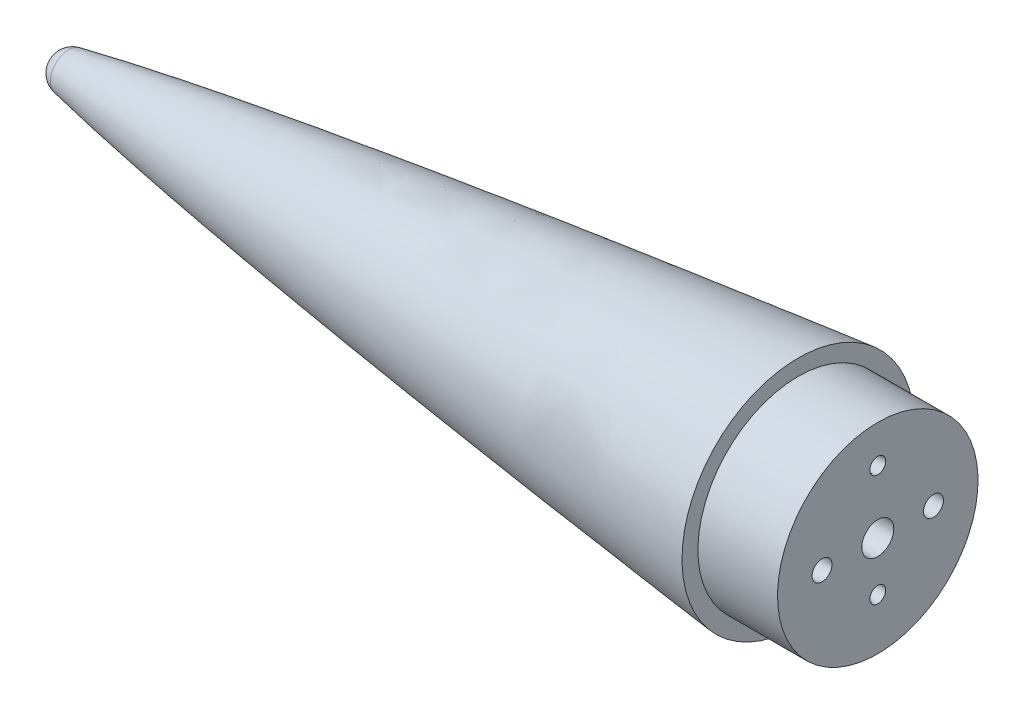
ISO-10303-21;
HEADER;
FILE_DESCRIPTION(('STEP AP214'),'2;1');
FILE_NAME('part.step','',(''),(''),'','','');
FILE_SCHEMA(('AUTOMOTIVE_DESIGN { 1 0 10303 214 1 1 1 1 }'));
ENDSEC;
DATA;
#1=APPLICATION_CONTEXT('core data for automotive mechanical design processes');
#2=APPLICATION_PROTOCOL_DEFINITION('international standard','automotive_design',2000,#1);
#3=PRODUCT_CONTEXT('',#1,'mechanical');
#4=PRODUCT('Part','Part','',(#3));
#5=PRODUCT_RELATED_PRODUCT_CATEGORY('part','',(#4));
#6=PRODUCT_DEFINITION_FORMATION('','',#4);
#7=PRODUCT_DEFINITION_CONTEXT('part definition',#1,'design');
#8=PRODUCT_DEFINITION('design','',#6,#7);
#9=PRODUCT_DEFINITION_SHAPE('','',#8);
#10=(LENGTH_UNIT() NAMED_UNIT(*) SI_UNIT(.MILLI.,.METRE.));
#11=(NAMED_UNIT(*) PLANE_ANGLE_UNIT() SI_UNIT($,.RADIAN.));
#12=(NAMED_UNIT(*) SI_UNIT($,.STERADIAN.) SOLID_ANGLE_UNIT());
#13=UNCERTAINTY_MEASURE_WITH_UNIT(LENGTH_MEASURE(1.E-05),#10,'distance_accuracy_value','');
#14=(GEOMETRIC_REPRESENTATION_CONTEXT(3) GLOBAL_UNCERTAINTY_ASSIGNED_CONTEXT((#13)) GLOBAL_UNIT_ASSIGNED_CONTEXT((#10,
#11,#12)) REPRESENTATION_CONTEXT('',''));
#15=CARTESIAN_POINT('',(0.,0.,0.));
#16=DIRECTION('',(0.,0.,1.));
#17=DIRECTION('',(1.,0.,0.));
#18=AXIS2_PLACEMENT_3D('',#15,#16,#17);
#19=CARTESIAN_POINT('',(25.4,1.27,0.));
#20=CARTESIAN_POINT('',(63.6118581815148,4.61310440314288,0.));
#21=CARTESIAN_POINT('',(101.82371636303,7.95620880628577,0.));
#22=CARTESIAN_POINT('',(140.035574544544,11.2993132094287,0.));
#23=CARTESIAN_POINT('',(25.4,1.27,0.0350466031301165));
#24=CARTESIAN_POINT('',(63.6118581815148,4.61310440314288,0.0350466031301165));
#25=CARTESIAN_POINT('',(101.82371636303,7.95620880628577,0.0350466031301166));
#26=CARTESIAN_POINT('',(140.035574544544,11.2993132094287,0.0350466031301166));
#27=CARTESIAN_POINT('',(25.4,1.26715466031301,0.104480488764327));
#28=CARTESIAN_POINT('',(63.6118581815148,4.61025906345589,0.104480488764327));
#29=CARTESIAN_POINT('',(101.82371636303,7.95336346659878,0.104480488764327));
#30=CARTESIAN_POINT('',(140.035574544544,11.2964678697417,0.104480488764327));
#31=CARTESIAN_POINT('',(25.4,1.25467853458071,0.206325452478428));
#32=CARTESIAN_POINT('',(63.6118581815148,4.59778293772359,0.206325452478428));
#33=CARTESIAN_POINT('',(101.82371636303,7.94088734086647,0.206325452478428));
#34=CARTESIAN_POINT('',(140.035574544544,11.2839917440094,0.206325452478428));
#35=CARTESIAN_POINT('',(25.4,1.23432219550573,0.305536648596169));
#36=CARTESIAN_POINT('',(63.6118581815148,4.57742659864861,0.305536648596169));
#37=CARTESIAN_POINT('',(101.82371636303,7.9205310017915,0.305536648596169));
#38=CARTESIAN_POINT('',(140.035574544544,11.2636354049344,0.305536648596169));
#39=CARTESIAN_POINT('',(25.4,1.06687029815468,0.88303380256959));
#40=CARTESIAN_POINT('',(63.6118581815148,4.40997470129756,0.88303380256959));
#41=CARTESIAN_POINT('',(101.82371636303,7.75307910444044,0.88303380256959));
#42=CARTESIAN_POINT('',(140.035574544544,11.0961835075833,0.88303380256959));
#43=CARTESIAN_POINT('',(25.4,0.56074565008187,1.27));
#44=CARTESIAN_POINT('',(63.6118581815148,3.90385005322475,1.27));
#45=CARTESIAN_POINT('',(101.82371636303,7.24695445636764,1.27));
#46=CARTESIAN_POINT('',(140.035574544544,10.5900588595105,1.27));
#47=CARTESIAN_POINT('',(25.4,-0.700932062602337,1.27));
#48=CARTESIAN_POINT('',(63.6118581815148,2.64217234054055,1.27));
#49=CARTESIAN_POINT('',(101.82371636303,5.98527674368343,1.27));
#50=CARTESIAN_POINT('',(140.035574544544,9.32838114682631,1.27));
#51=CARTESIAN_POINT('',(25.4,-1.27,0.700932062602337));
#52=CARTESIAN_POINT('',(63.6118581815148,2.07310440314288,0.700932062602337));
#53=CARTESIAN_POINT('',(101.82371636303,5.41620880628577,0.700932062602337));
#54=CARTESIAN_POINT('',(140.035574544544,8.75931320942865,0.700932062602337));
#55=CARTESIAN_POINT('',(25.4,-1.27,-0.700932062602337));
#56=CARTESIAN_POINT('',(63.6118581815148,2.07310440314288,-0.700932062602337));
#57=CARTESIAN_POINT('',(101.82371636303,5.41620880628577,-0.700932062602337));
#58=CARTESIAN_POINT('',(140.035574544544,8.75931320942865,-0.700932062602337));
#59=CARTESIAN_POINT('',(25.4,-0.700932062602337,-1.27));
#60=CARTESIAN_POINT('',(63.6118581815148,2.64217234054055,-1.27));
#61=CARTESIAN_POINT('',(101.82371636303,5.98527674368343,-1.27));
#62=CARTESIAN_POINT('',(140.035574544544,9.32838114682631,-1.27));
#63=CARTESIAN_POINT('',(25.4,0.560745650081869,-1.27));
#64=CARTESIAN_POINT('',(63.6118581815148,3.90385005322475,-1.27));
#65=CARTESIAN_POINT('',(101.82371636303,7.24695445636764,-1.27));
#66=CARTESIAN_POINT('',(140.035574544544,10.5900588595105,-1.27));
#67=CARTESIAN_POINT('',(25.4,1.06687029815468,-0.88303380256959));
#68=CARTESIAN_POINT('',(63.6118581815148,4.40997470129756,-0.88303380256959));
#69=CARTESIAN_POINT('',(101.82371636303,7.75307910444044,-0.88303380256959));
#70=CARTESIAN_POINT('',(140.035574544544,11.0961835075833,-0.88303380256959));
#71=CARTESIAN_POINT('',(25.4,1.23432219550573,-0.305536648596169));
#72=CARTESIAN_POINT('',(63.6118581815148,4.57742659864862,-0.305536648596169));
#73=CARTESIAN_POINT('',(101.82371636303,7.9205310017915,-0.305536648596169));
#74=CARTESIAN_POINT('',(140.035574544544,11.2636354049344,-0.305536648596169));
#75=CARTESIAN_POINT('',(25.4,1.25467853458071,-0.206325452478428));
#76=CARTESIAN_POINT('',(63.6118581815148,4.59778293772359,-0.206325452478428));
#77=CARTESIAN_POINT('',(101.82371636303,7.94088734086647,-0.206325452478428));
#78=CARTESIAN_POINT('',(140.035574544544,11.2839917440094,-0.206325452478428));
#79=CARTESIAN_POINT('',(25.4,1.26715466031301,-0.104480488764327));
#80=CARTESIAN_POINT('',(63.6118581815148,4.61025906345589,-0.104480488764327));
#81=CARTESIAN_POINT('',(101.82371636303,7.95336346659878,-0.104480488764327));
#82=CARTESIAN_POINT('',(140.035574544544,11.2964678697417,-0.104480488764327));
#83=CARTESIAN_POINT('',(25.4,1.27,-0.0350466031301169));
#84=CARTESIAN_POINT('',(63.6118581815148,4.61310440314288,-0.0350466031301169));
#85=CARTESIAN_POINT('',(101.82371636303,7.95620880628577,-0.0350466031301169));
#86=CARTESIAN_POINT('',(140.035574544544,11.2993132094287,-0.0350466031301169));
#87=CARTESIAN_POINT('',(25.4,1.27,0.));
#88=CARTESIAN_POINT('',(63.6118581815148,4.61310440314288,0.));
#89=CARTESIAN_POINT('',(101.82371636303,7.95620880628577,0.));
#90=CARTESIAN_POINT('',(140.035574544544,11.2993132094287,0.));
#91=B_SPLINE_SURFACE_WITH_KNOTS('',3,3,((#19,#20,#21,#22),(#23,#24,#25,#26),(#27,#28,#29,#30),
(#31,#32,#33,#34),(#35,#36,#37,#38),(#39,#40,#41,#42),(#43,#44,#45,#46),(#47,#48,#49,#50),(#51,
#52,#53,#54),(#55,#56,#57,#58),(#59,#60,#61,#62),(#63,#64,#65,#66),(#67,#68,#69,#70),(#71,#72,
#73,#74),(#75,#76,#77,#78),(#79,#80,#81,#82),(#83,#84,#85,#86),(#87,#88,#89,#90)),.UNSPECIFIED.,
.T.,.F.,.F.,(4,1,1,1,1,2,2,2,1,1,1,1,4),(4,4),(0.,0.0125,0.0249999999999999,0.0375000000000001,
0.05,0.25,0.5,0.75,0.95,0.9625,0.975,0.9875,1.),(0.,1.),.UNSPECIFIED.);
#92=CARTESIAN_POINT('',(140.035574544544,10.0293132094286,0.));
#93=DIRECTION('',(1.,0.,0.));
#94=DIRECTION('',(0.,1.,0.));
#95=AXIS2_PLACEMENT_3D('',#92,#93,#94);
#96=CIRCLE('',#95,1.27);
#97=CARTESIAN_POINT('',(140.035574544544,11.2993132094287,0.));
#98=VERTEX_POINT('',#97);
#99=EDGE_CURVE('E279',#98,#98,#96,.T.);
#100=CARTESIAN_POINT('',(25.4,0.,0.));
#101=DIRECTION('',(1.,0.,0.));
#102=DIRECTION('',(0.,0.,-1.));
#103=AXIS2_PLACEMENT_3D('',#100,#101,#102);
#104=CIRCLE('',#103,1.27);
#105=CARTESIAN_POINT('',(25.4,0.,-1.27));
#106=VERTEX_POINT('',#105);
#107=EDGE_CURVE('E132',#106,#106,#104,.T.);
#108=CARTESIAN_POINT('',(50.8,1.28529523678131,-0.857017253165904));
#109=CARTESIAN_POINT('',(50.8,1.26120830030249,-0.830700503232783));
#110=CARTESIAN_POINT('',(50.8,1.23823251397369,-0.803389429955764));
#111=CARTESIAN_POINT('',(50.8,1.19464513559847,-0.746941111774847));
#112=CARTESIAN_POINT('',(50.8,1.17403358840814,-0.71780383223904));
#113=CARTESIAN_POINT('',(50.8,1.11604190689717,-0.628025593318513));
#114=CARTESIAN_POINT('',(50.8,1.08240096127345,-0.564904752079824));
#115=CARTESIAN_POINT('',(50.8,1.02622663234572,-0.433866088811166));
#116=CARTESIAN_POINT('',(50.8,1.00370445255427,-0.365943506880282));
#117=CARTESIAN_POINT('',(50.8,0.970477624111287,-0.227226756853895));
#118=CARTESIAN_POINT('',(50.8,0.959772860306507,-0.156432616746877));
#119=CARTESIAN_POINT('',(50.8,0.952678793312112,-0.0498769815468284));
#120=CARTESIAN_POINT('',(50.8,0.951802015297102,-0.0143569682782258));
#121=CARTESIAN_POINT('',(50.8,0.952967584545823,0.0566352104399586));
#122=CARTESIAN_POINT('',(50.8,0.955009896506509,0.0921073764630048));
#123=CARTESIAN_POINT('',(50.8,0.965595570760762,0.198087641531462));
#124=CARTESIAN_POINT('',(50.8,0.97859449177166,0.268206643931548));
#125=CARTESIAN_POINT('',(50.8,1.01639889489829,0.405874702870775));
#126=CARTESIAN_POINT('',(50.8,1.04131793227744,0.473392146768693));
#127=CARTESIAN_POINT('',(50.8,1.10222776731392,0.60319413574191));
#128=CARTESIAN_POINT('',(50.8,1.1382060597687,0.66548449056514));
#129=CARTESIAN_POINT('',(50.8,1.19531596460632,0.747553919408984));
#130=CARTESIAN_POINT('',(50.8,1.21230692623682,0.770305199430718));
#131=CARTESIAN_POINT('',(50.8,1.24773171854024,0.814583337083755));
#132=CARTESIAN_POINT('',(50.8,1.26616270011925,0.836112473907997));
#133=CARTESIAN_POINT('',(50.8,1.28529523678131,0.857017253165905));
#134=B_SPLINE_CURVE_WITH_KNOTS('',3,(#108,#109,#110,#111,#112,#113,#114,#115,#116,#117,#118,
#119,#120,#121,#122,#123,#124,#125,#126,#127,#128,#129,#130,#131,#132,#133),.UNSPECIFIED.,.F.,
.F.,(4,2,2,2,2,2,2,2,2,2,2,2,4),(0.,0.106962050233379,0.213926129493577,0.427398756675607,
0.641086046757289,0.854771254573214,0.96126086173657,1.06774918104115,1.28058585247654,
1.49549173122509,1.71015549451011,1.79529305977988,1.88026624932621),.UNSPECIFIED.);
#135=CARTESIAN_POINT('',(50.8,1.11114409783544,-0.615260193510835));
#136=VERTEX_POINT('',#135);
#137=CARTESIAN_POINT('',(50.8,1.11113297416813,0.615240234713057));
#138=VERTEX_POINT('',#137);
#139=EDGE_CURVE('E14',#136,#138,#134,.T.);
#140=CARTESIAN_POINT('',(50.7999999999998,1.11110602677922,-0.615191852019089));
#141=CARTESIAN_POINT('',(50.8698781786029,1.11110602677923,-0.604173069618746));
#142=CARTESIAN_POINT('',(50.9397019217196,1.11110602677924,-0.592793666969383));
#143=CARTESIAN_POINT('',(51.0793352790334,1.11110602677924,-0.569117732184979));
#144=CARTESIAN_POINT('',(51.1491445927795,1.11110602677924,-0.556819432534417));
#145=CARTESIAN_POINT('',(51.2886234905257,1.11110602677924,-0.531141654962112));
#146=CARTESIAN_POINT('',(51.358292916837,1.11110602677924,-0.517761314795605));
#147=CARTESIAN_POINT('',(51.4962490388009,1.11110602677924,-0.489889899770374));
#148=CARTESIAN_POINT('',(51.5645399896364,1.11110602677924,-0.47542008208526));
#149=CARTESIAN_POINT('',(51.7007081739943,1.11110602677924,-0.44482267570196));
#150=CARTESIAN_POINT('',(51.7685856328018,1.11110602677924,-0.42869609516146));
#151=CARTESIAN_POINT('',(51.9037438327204,1.11110602677924,-0.394201914187369));
#152=CARTESIAN_POINT('',(51.9710248893474,1.11110602677924,-0.375835585244884));
#153=CARTESIAN_POINT('',(52.0596672491461,1.11110602677924,-0.3492435397578));
#154=CARTESIAN_POINT('',(52.0814746120651,1.11110602677924,-0.342506735960934));
#155=CARTESIAN_POINT('',(52.1249548373515,1.11110602677924,-0.32860534005104));
#156=CARTESIAN_POINT('',(52.1466276798344,1.11110602677924,-0.321440686282424));
#157=CARTESIAN_POINT('',(52.2117232973931,1.11110602677924,-0.299093068114507));
#158=CARTESIAN_POINT('',(52.2548975575721,1.11110602677924,-0.283151782887929));
#159=CARTESIAN_POINT('',(52.3189513140578,1.11110602677924,-0.256857704328056));
#160=CARTESIAN_POINT('',(52.3402962254613,1.11110602677924,-0.247640492312448));
#161=CARTESIAN_POINT('',(52.3825133372089,1.11110602677924,-0.228187185672467));
#162=CARTESIAN_POINT('',(52.4033857539186,1.11110602677924,-0.217951569476882));
#163=CARTESIAN_POINT('',(52.4442287644187,1.11110602677924,-0.196195366319065));
#164=CARTESIAN_POINT('',(52.4642054843789,1.11110602677924,-0.18468635787995));
#165=CARTESIAN_POINT('',(52.5029214858518,1.11110602677924,-0.15975990468138));
#166=CARTESIAN_POINT('',(52.5216641850693,1.11110602677924,-0.146348086137208));
#167=CARTESIAN_POINT('',(52.5470321718472,1.11110602677924,-0.124795731418952));
#168=CARTESIAN_POINT('',(52.5546413172591,1.11110602677924,-0.117825381606004));
#169=CARTESIAN_POINT('',(52.5691468164091,1.11110602677924,-0.103130425418306));
#170=CARTESIAN_POINT('',(52.5760413877036,1.11110602677924,-0.0954040221442286));
#171=CARTESIAN_POINT('',(52.5888310041151,1.11110602677924,-0.078944987843746));
#172=CARTESIAN_POINT('',(52.5947085859489,1.11110602677924,-0.0701984188029956));
#173=CARTESIAN_POINT('',(52.6046831746341,1.11110602677924,-0.0517499409501113));
#174=CARTESIAN_POINT('',(52.6087898375821,1.11110602677924,-0.0420535760582059));
#175=CARTESIAN_POINT('',(52.6134273676194,1.11110602677924,-0.0256879423300923));
#176=CARTESIAN_POINT('',(52.6147202584994,1.11110602677924,-0.0192354169813169));
#177=CARTESIAN_POINT('',(52.6161835356838,1.11110602677924,-0.00620408166601703));
#178=CARTESIAN_POINT('',(52.616354751337,1.11110602677924,0.000374631388779915));
#179=CARTESIAN_POINT('',(52.6155560567165,1.11110602677924,0.0134526198582712));
#180=CARTESIAN_POINT('',(52.6145874256411,1.11110602677924,0.0199519760674673));
#181=CARTESIAN_POINT('',(52.6116148384409,1.11110602677924,0.0327169515080686));
#182=CARTESIAN_POINT('',(52.6096087446819,1.11110602677924,0.0389820593930017));
#183=CARTESIAN_POINT('',(52.6001677620796,1.11110602677924,0.0626198065105098));
#184=CARTESIAN_POINT('',(52.5896188998754,1.11110602677924,0.078720472876247));
#185=CARTESIAN_POINT('',(52.5659930572189,1.11110602677924,0.107170067826564));
#186=CARTESIAN_POINT('',(52.553070217133,1.11110602677924,0.1196671426899));
#187=CARTESIAN_POINT('',(52.5325413242334,1.11110602677924,0.137106319073765));
#188=CARTESIAN_POINT('',(52.5254914862818,1.11110602677924,0.142712082151355));
#189=CARTESIAN_POINT('',(52.5110988430241,1.11110602677924,0.153533764871675));
#190=CARTESIAN_POINT('',(52.5037559920535,1.11110602677924,0.158749623382859));
#191=CARTESIAN_POINT('',(52.4746021229245,1.11110602677924,0.178527749635543));
#192=CARTESIAN_POINT('',(52.4519779239362,1.11110602677924,0.191887546919637));
#193=CARTESIAN_POINT('',(52.4057374536467,1.11110602677924,0.216843235051474));
#194=CARTESIAN_POINT('',(52.3821185504101,1.11110602677924,0.228434015194313));
#195=CARTESIAN_POINT('',(52.3342613286455,1.11110602677924,0.25034727141069));
#196=CARTESIAN_POINT('',(52.3100221559577,1.11110602677924,0.260667870675974));
#197=CARTESIAN_POINT('',(52.2608639571167,1.11110602677924,0.280459980191173));
#198=CARTESIAN_POINT('',(52.2359402536904,1.11110602677924,0.289919706562012));
#199=CARTESIAN_POINT('',(52.18586278608,1.11110602677924,0.308046772376167));
#200=CARTESIAN_POINT('',(52.1607095627145,1.11110602677924,0.316715615060967));
#201=CARTESIAN_POINT('',(52.1102150700144,1.11110602677924,0.333422325779162));
#202=CARTESIAN_POINT('',(52.0848739418466,1.11110602677924,0.341460623500218));
#203=CARTESIAN_POINT('',(52.0063030471172,1.11110602677924,0.36551450706441));
#204=CARTESIAN_POINT('',(51.9528088038751,1.11110602677924,0.380665842526637));
#205=CARTESIAN_POINT('',(51.8453504817321,1.11110602677924,0.40937546694069));
#206=CARTESIAN_POINT('',(51.791386017424,1.11110602677924,0.422932284287098));
#207=CARTESIAN_POINT('',(51.6831108033676,1.11110602677924,0.448823982241647));
#208=CARTESIAN_POINT('',(51.6287997679965,1.11110602677924,0.461157662225381));
#209=CARTESIAN_POINT('',(51.5199328182881,1.11110602677924,0.484847003506528));
#210=CARTESIAN_POINT('',(51.4653767784121,1.11110602677924,0.496202083667703));
#211=CARTESIAN_POINT('',(51.3599658480694,1.11110602677924,0.517326913997676));
#212=CARTESIAN_POINT('',(51.3091219910061,1.11110602677924,0.527151988707672));
#213=CARTESIAN_POINT('',(51.2073568947984,1.11110602677924,0.546198811522596));
#214=CARTESIAN_POINT('',(51.1564357300906,1.11110602677924,0.555420958498663));
#215=CARTESIAN_POINT('',(51.0545784712039,1.11110602677924,0.573336440177065));
#216=CARTESIAN_POINT('',(51.0036425106516,1.11110602677924,0.582030537300635));
#217=CARTESIAN_POINT('',(50.9018143553401,1.11110602677924,0.598945015336738));
#218=CARTESIAN_POINT('',(50.8509223369837,1.11110602677924,0.607166456939176));
#219=CARTESIAN_POINT('',(50.7999999999993,1.11110602677924,0.615191852014096));
#220=B_SPLINE_CURVE_WITH_KNOTS('',3,(#140,#141,#142,#143,#144,#145,#146,#147,#148,#149,#150,
#151,#152,#153,#154,#155,#156,#157,#158,#159,#160,#161,#162,#163,#164,#165,#166,#167,#168,#169,
#170,#171,#172,#173,#174,#175,#176,#177,#178,#179,#180,#181,#182,#183,#184,#185,#186,#187,#188,
#189,#190,#191,#192,#193,#194,#195,#196,#197,#198,#199,#200,#201,#202,#203,#204,#205,#206,#207,
#208,#209,#210,#211,#212,#213,#214,#215,#216,#217,#218,#219),.UNSPECIFIED.,.F.,.F.,(4,2,2,2,2,2,
2,2,2,2,2,2,2,2,2,2,2,2,2,2,2,2,2,2,2,2,2,2,2,2,2,2,2,2,2,2,2,2,2,4),(0.,0.212227453102567,
0.424874194505733,0.637692089661275,0.847096596691854,1.05637442525694,1.26553399639251,
1.33400234175481,1.40248057771257,1.54045434782028,1.61018702045152,1.67988708717508,
1.74899868212946,1.81791002983829,1.84883078576759,1.87982690299621,1.91131147556683,
1.94262213557455,1.96227774521146,1.98191882015843,2.00153787382051,2.02119751346882,
2.07783421999677,2.13161758133779,2.15862353039592,2.18563370476445,2.26429997318147,
2.34318937397668,2.42219397616169,2.50215445228829,2.5819596343616,2.66170995166492,
2.8284648515432,2.99537246413437,3.16244232344484,3.32961072230446,3.48496003015935,
3.64020550330757,3.79522121957543,3.94987427088854),.UNSPECIFIED.);
#221=EDGE_CURVE('E106',#136,#138,#220,.T.);
#222=ORIENTED_EDGE('',*,*,#99,.T.);
#223=EDGE_LOOP('',(#222));
#224=FACE_BOUND('',#223,.T.);
#225=ORIENTED_EDGE('',*,*,#107,.F.);
#226=EDGE_LOOP('',(#225));
#227=FACE_BOUND('',#226,.T.);
#228=ORIENTED_EDGE('',*,*,#139,.F.);
#229=ORIENTED_EDGE('',*,*,#221,.T.);
#230=EDGE_LOOP('',(#228,#229));
#231=FACE_BOUND('',#230,.T.);
#232=ADVANCED_FACE('F93',(#224,#227,#231),#91,.F.);
#233=CARTESIAN_POINT('',(127.335574544546,18.5420000000002,0.));
#234=CARTESIAN_POINT('',(123.985371179069,18.1761120559446,0.));
#235=CARTESIAN_POINT('',(116.544443233424,17.3563346616778,0.));
#236=CARTESIAN_POINT('',(105.011198620997,16.0596521476055,0.));
#237=CARTESIAN_POINT('',(89.399028543661,14.2397703202738,0.));
#238=CARTESIAN_POINT('',(73.0527930203919,12.2464588927701,0.));
#239=CARTESIAN_POINT('',(56.7226826856592,10.1420110625643,0.));
#240=CARTESIAN_POINT('',(40.8773630708659,7.95239606991336,0.));
#241=CARTESIAN_POINT('',(27.3833397919858,5.90565006038425,0.));
#242=CARTESIAN_POINT('',(17.9855021199935,4.30724641265277,0.));
#243=CARTESIAN_POINT('',(12.6662135807664,3.29077731035264,0.));
#244=CARTESIAN_POINT('',(10.9314412311846,2.94072919703407,0.));
#245=B_SPLINE_CURVE_WITH_KNOTS('',4,(#233,#234,#235,#236,#237,#238,#239,#240,#241,#242,#243,
#244),.UNSPECIFIED.,.F.,.F.,(5,1,1,1,1,1,1,1,5),(0.0447918321120015,0.0979613557964112,
0.162897908081811,0.227834459197782,0.292771011809077,0.357707561913071,0.422644115533411,
0.480152171759511,0.508069688487373),.UNSPECIFIED.);
#246=CARTESIAN_POINT('',(8.52483131343349,0.,0.));
#247=DIRECTION('',(-1.,0.,0.));
#248=AXIS1_PLACEMENT('',#246,#247);
#249=SURFACE_OF_REVOLUTION('',#245,#248);
#250=CARTESIAN_POINT('',(10.9314412311839,0.,0.));
#251=DIRECTION('',(-1.,0.,0.));
#252=DIRECTION('',(0.,-1.,0.));
#253=AXIS2_PLACEMENT_3D('',#250,#251,#252);
#254=CIRCLE('',#253,2.94072919703394);
#255=CARTESIAN_POINT('',(10.9314412311839,-2.94072919703394,0.));
#256=VERTEX_POINT('',#255);
#257=EDGE_CURVE('E261',#256,#256,#254,.T.);
#258=ORIENTED_EDGE('',*,*,#257,.F.);
#259=EDGE_LOOP('',(#258));
#260=FACE_BOUND('',#259,.T.);
#261=CARTESIAN_POINT('',(127.335574544544,0.,0.));
#262=DIRECTION('',(-1.,0.,0.));
#263=DIRECTION('',(0.,-1.,0.));
#264=AXIS2_PLACEMENT_3D('',#261,#262,#263);
#265=CIRCLE('',#264,18.542);
#266=CARTESIAN_POINT('',(127.335574544544,-18.542,0.));
#267=VERTEX_POINT('',#266);
#268=EDGE_CURVE('E255',#267,#267,#265,.T.);
#269=ORIENTED_EDGE('',*,*,#268,.T.);
#270=EDGE_LOOP('',(#269));
#271=FACE_BOUND('',#270,.T.);
#272=ADVANCED_FACE('F96',(#260,#271),#249,.T.);
#273=CARTESIAN_POINT('',(11.5248313134335,0.,0.));
#274=DIRECTION('',(-1.,0.,0.));
#275=DIRECTION('',(0.,1.,0.));
#276=AXIS2_PLACEMENT_3D('',#273,#274,#275);
#277=SPHERICAL_SURFACE('',#276,3.);
#278=ORIENTED_EDGE('',*,*,#257,.T.);
#279=EDGE_LOOP('',(#278));
#280=FACE_BOUND('',#279,.T.);
#281=ADVANCED_FACE('F141',(#280),#277,.T.);
#282=CARTESIAN_POINT('',(127.335574544544,0.,0.));
#283=DIRECTION('',(-1.,0.,0.));
#284=DIRECTION('',(0.,-1.,0.));
#285=AXIS2_PLACEMENT_3D('',#282,#283,#284);
#286=PLANE('',#285);
#287=CARTESIAN_POINT('',(127.335574544544,0.,0.));
#288=DIRECTION('',(1.,0.,0.));
#289=DIRECTION('',(0.,1.,0.));
#290=AXIS2_PLACEMENT_3D('',#287,#288,#289);
#291=CIRCLE('',#290,16.002);
#292=CARTESIAN_POINT('',(127.335574544544,16.002,0.));
#293=VERTEX_POINT('',#292);
#294=EDGE_CURVE('E126',#293,#293,#291,.T.);
#295=ORIENTED_EDGE('',*,*,#294,.F.);
#296=EDGE_LOOP('',(#295));
#297=FACE_BOUND('',#296,.T.);
#298=ORIENTED_EDGE('',*,*,#268,.F.);
#299=EDGE_LOOP('',(#298));
#300=FACE_BOUND('',#299,.T.);
#301=ADVANCED_FACE('F355',(#297,#300),#286,.F.);
#302=CARTESIAN_POINT('',(140.035574544544,0.,0.));
#303=DIRECTION('',(-1.,0.,0.));
#304=DIRECTION('',(0.,-1.,0.));
#305=AXIS2_PLACEMENT_3D('',#302,#303,#304);
#306=CYLINDRICAL_SURFACE('',#305,16.002);
#307=CARTESIAN_POINT('',(140.035574544544,0.,0.));
#308=DIRECTION('',(1.,0.,0.));
#309=DIRECTION('',(0.,1.,0.));
#310=AXIS2_PLACEMENT_3D('',#307,#308,#309);
#311=CIRCLE('',#310,16.002);
#312=CARTESIAN_POINT('',(140.035574544544,16.002,0.));
#313=VERTEX_POINT('',#312);
#314=EDGE_CURVE('E250',#313,#313,#311,.T.);
#315=ORIENTED_EDGE('',*,*,#314,.F.);
#316=EDGE_LOOP('',(#315));
#317=FACE_BOUND('',#316,.T.);
#318=ORIENTED_EDGE('',*,*,#294,.T.);
#319=EDGE_LOOP('',(#318));
#320=FACE_BOUND('',#319,.T.);
#321=ADVANCED_FACE('F295',(#317,#320),#306,.T.);
#322=CARTESIAN_POINT('',(140.035574544544,0.,0.));
#323=DIRECTION('',(1.,0.,0.));
#324=DIRECTION('',(0.,1.,0.));
#325=AXIS2_PLACEMENT_3D('',#322,#323,#324);
#326=PLANE('',#325);
#327=CARTESIAN_POINT('',(140.035574544544,0.,8.89));
#328=DIRECTION('',(-1.,0.,0.));
#329=DIRECTION('',(0.,1.,0.));
#330=AXIS2_PLACEMENT_3D('',#327,#328,#329);
#331=CIRCLE('',#330,1.5875);
#332=CARTESIAN_POINT('',(140.035574544544,1.5875,8.89));
#333=VERTEX_POINT('',#332);
#334=EDGE_CURVE('E234',#333,#333,#331,.T.);
#335=ORIENTED_EDGE('',*,*,#334,.T.);
#336=EDGE_LOOP('',(#335));
#337=FACE_BOUND('',#336,.T.);
#338=CARTESIAN_POINT('',(140.035574544544,0.,-8.89));
#339=DIRECTION('',(1.,0.,0.));
#340=DIRECTION('',(0.,1.,0.));
#341=AXIS2_PLACEMENT_3D('',#338,#339,#340);
#342=CIRCLE('',#341,1.5875);
#343=CARTESIAN_POINT('',(140.035574544544,1.5875,-8.89));
#344=VERTEX_POINT('',#343);
#345=EDGE_CURVE('E233',#344,#344,#342,.T.);
#346=ORIENTED_EDGE('',*,*,#345,.F.);
#347=EDGE_LOOP('',(#346));
#348=FACE_BOUND('',#347,.T.);
#349=CARTESIAN_POINT('',(140.035574544544,-7.80710115587018,0.));
#350=DIRECTION('',(1.,0.,0.));
#351=DIRECTION('',(0.,1.,0.));
#352=AXIS2_PLACEMENT_3D('',#349,#350,#351);
#353=CIRCLE('',#352,1.27);
#354=CARTESIAN_POINT('',(140.035574544544,-6.53710115587018,0.));
#355=VERTEX_POINT('',#354);
#356=EDGE_CURVE('E133',#355,#355,#353,.T.);
#357=ORIENTED_EDGE('',*,*,#356,.F.);
#358=EDGE_LOOP('',(#357));
#359=FACE_BOUND('',#358,.T.);
#360=ORIENTED_EDGE('',*,*,#99,.F.);
#361=EDGE_LOOP('',(#360));
#362=FACE_BOUND('',#361,.T.);
#363=CARTESIAN_POINT('',(140.035574544544,0.,0.));
#364=DIRECTION('',(1.,0.,0.));
#365=DIRECTION('',(0.,0.,-1.));
#366=AXIS2_PLACEMENT_3D('',#363,#364,#365);
#367=CIRCLE('',#366,2.55269999999999);
#368=CARTESIAN_POINT('',(140.035574544544,0.,-2.55269999999999));
#369=VERTEX_POINT('',#368);
#370=EDGE_CURVE('E327',#369,#369,#367,.T.);
#371=ORIENTED_EDGE('',*,*,#370,.F.);
#372=EDGE_LOOP('',(#371));
#373=FACE_BOUND('',#372,.T.);
#374=ORIENTED_EDGE('',*,*,#314,.T.);
#375=EDGE_LOOP('',(#374));
#376=FACE_BOUND('',#375,.T.);
#377=ADVANCED_FACE('F284',(#337,#348,#359,#362,#373,#376),#326,.T.);
#378=CARTESIAN_POINT('',(123.525574544544,0.,0.));
#379=DIRECTION('',(1.,0.,0.));
#380=DIRECTION('',(0.,0.,-1.));
#381=AXIS2_PLACEMENT_3D('',#378,#379,#380);
#382=CONICAL_SURFACE('',#381,2.55269999999999,1.02974425867665);
#383=CARTESIAN_POINT('',(121.991757642353,0.,0.));
#384=VERTEX_POINT('',#383);
#385=VERTEX_LOOP('',#384);
#386=FACE_BOUND('',#385,.T.);
#387=CARTESIAN_POINT('',(123.525574544544,0.,0.));
#388=DIRECTION('',(1.,0.,0.));
#389=DIRECTION('',(0.,0.,-1.));
#390=AXIS2_PLACEMENT_3D('',#387,#388,#389);
#391=CIRCLE('',#390,2.55269999999999);
#392=CARTESIAN_POINT('',(123.525574544544,0.,-2.55269999999999));
#393=VERTEX_POINT('',#392);
#394=EDGE_CURVE('E256',#393,#393,#391,.T.);
#395=ORIENTED_EDGE('',*,*,#394,.T.);
#396=EDGE_LOOP('',(#395));
#397=FACE_BOUND('',#396,.T.);
#398=ADVANCED_FACE('F294',(#386,#397),#382,.F.);
#399=CARTESIAN_POINT('',(140.035574544544,0.,0.));
#400=DIRECTION('',(1.,0.,0.));
#401=DIRECTION('',(0.,0.,-1.));
#402=AXIS2_PLACEMENT_3D('',#399,#400,#401);
#403=CYLINDRICAL_SURFACE('',#402,2.55269999999999);
#404=ORIENTED_EDGE('',*,*,#394,.F.);
#405=EDGE_LOOP('',(#404));
#406=FACE_BOUND('',#405,.T.);
#407=ORIENTED_EDGE('',*,*,#370,.T.);
#408=EDGE_LOOP('',(#407));
#409=FACE_BOUND('',#408,.T.);
#410=ADVANCED_FACE('F156',(#406,#409),#403,.F.);
#411=CARTESIAN_POINT('',(25.4,0.,0.));
#412=DIRECTION('',(1.,0.,0.));
#413=DIRECTION('',(0.,0.,-1.));
#414=AXIS2_PLACEMENT_3D('',#411,#412,#413);
#415=PLANE('',#414);
#416=ORIENTED_EDGE('',*,*,#107,.T.);
#417=EDGE_LOOP('',(#416));
#418=FACE_BOUND('',#417,.T.);
#419=ADVANCED_FACE('F152',(#418),#415,.T.);
#420=CARTESIAN_POINT('',(50.8,0.,0.));
#421=DIRECTION('',(1.,0.,0.));
#422=DIRECTION('',(0.,0.,-1.));
#423=AXIS2_PLACEMENT_3D('',#420,#421,#422);
#424=PLANE('',#423);
#425=ORIENTED_EDGE('',*,*,#139,.T.);
#426=CARTESIAN_POINT('',(50.8,0.,0.));
#427=DIRECTION('',(1.,0.,0.));
#428=DIRECTION('',(0.,0.,-1.));
#429=AXIS2_PLACEMENT_3D('',#426,#427,#428);
#430=CIRCLE('',#429,1.27);
#431=EDGE_CURVE('E99',#138,#136,#430,.T.);
#432=ORIENTED_EDGE('',*,*,#431,.T.);
#433=EDGE_LOOP('',(#425,#432));
#434=FACE_BOUND('',#433,.T.);
#435=ADVANCED_FACE('F130',(#434),#424,.T.);
#436=CARTESIAN_POINT('',(140.035574544544,-9.07710115587018,0.));
#437=CARTESIAN_POINT('',(110.290383029696,-6.47473410391345,0.));
#438=CARTESIAN_POINT('',(80.5451915148482,-3.87236705195673,0.));
#439=CARTESIAN_POINT('',(50.8,-1.27,0.));
#440=CARTESIAN_POINT('',(140.035574544544,-9.07710115587018,0.0350466031301171));
#441=CARTESIAN_POINT('',(110.290383029696,-6.47473410391345,0.0350466031301171));
#442=CARTESIAN_POINT('',(80.5451915148482,-3.87236705195673,0.0350466031301171));
#443=CARTESIAN_POINT('',(50.8,-1.27,0.0350466031301171));
#444=CARTESIAN_POINT('',(140.035574544544,-9.07425581618319,0.104480488764327));
#445=CARTESIAN_POINT('',(110.290383029696,-6.47188876422646,0.104480488764327));
#446=CARTESIAN_POINT('',(80.5451915148482,-3.86952171226974,0.104480488764327));
#447=CARTESIAN_POINT('',(50.8,-1.26715466031301,0.104480488764327));
#448=CARTESIAN_POINT('',(140.035574544544,-9.06177969045089,0.206325452478428));
#449=CARTESIAN_POINT('',(110.290383029696,-6.45941263849416,0.206325452478428));
#450=CARTESIAN_POINT('',(80.5451915148482,-3.85704558653743,0.206325452478428));
#451=CARTESIAN_POINT('',(50.8,-1.25467853458071,0.206325452478428));
#452=CARTESIAN_POINT('',(140.035574544544,-9.04142335137591,0.305536648596169));
#453=CARTESIAN_POINT('',(110.290383029696,-6.43905629941919,0.305536648596169));
#454=CARTESIAN_POINT('',(80.5451915148482,-3.83668924746246,0.305536648596169));
#455=CARTESIAN_POINT('',(50.8,-1.23432219550573,0.305536648596169));
#456=CARTESIAN_POINT('',(140.035574544544,-8.87397145402486,0.88303380256959));
#457=CARTESIAN_POINT('',(110.290383029696,-6.27160440206813,0.88303380256959));
#458=CARTESIAN_POINT('',(80.5451915148482,-3.6692373501114,0.88303380256959));
#459=CARTESIAN_POINT('',(50.8,-1.06687029815468,0.88303380256959));
#460=CARTESIAN_POINT('',(140.035574544544,-8.36784680595205,1.27));
#461=CARTESIAN_POINT('',(110.290383029696,-5.76547975399532,1.27));
#462=CARTESIAN_POINT('',(80.5451915148482,-3.16311270203859,1.27));
#463=CARTESIAN_POINT('',(50.8,-0.560745650081869,1.27));
#464=CARTESIAN_POINT('',(140.035574544544,-7.10616909326784,1.27));
#465=CARTESIAN_POINT('',(110.290383029696,-4.50380204131111,1.27));
#466=CARTESIAN_POINT('',(80.5451915148482,-1.90143498935439,1.27));
#467=CARTESIAN_POINT('',(50.8,0.700932062602338,1.27));
#468=CARTESIAN_POINT('',(140.035574544544,-6.53710115587018,0.700932062602337));
#469=CARTESIAN_POINT('',(110.290383029696,-3.93473410391345,0.700932062602337));
#470=CARTESIAN_POINT('',(80.5451915148482,-1.33236705195673,0.700932062602337));
#471=CARTESIAN_POINT('',(50.8,1.27,0.700932062602337));
#472=CARTESIAN_POINT('',(140.035574544544,-6.53710115587018,-0.700932062602337));
#473=CARTESIAN_POINT('',(110.290383029696,-3.93473410391345,-0.700932062602337));
#474=CARTESIAN_POINT('',(80.5451915148482,-1.33236705195673,-0.700932062602337));
#475=CARTESIAN_POINT('',(50.8,1.27,-0.700932062602338));
#476=CARTESIAN_POINT('',(140.035574544544,-7.10616909326784,-1.27));
#477=CARTESIAN_POINT('',(110.290383029696,-4.50380204131112,-1.27));
#478=CARTESIAN_POINT('',(80.5451915148482,-1.90143498935439,-1.27));
#479=CARTESIAN_POINT('',(50.8,0.700932062602337,-1.27));
#480=CARTESIAN_POINT('',(140.035574544544,-8.36784680595205,-1.27));
#481=CARTESIAN_POINT('',(110.290383029696,-5.76547975399532,-1.27));
#482=CARTESIAN_POINT('',(80.5451915148482,-3.1631127020386,-1.27));
#483=CARTESIAN_POINT('',(50.8,-0.56074565008187,-1.27));
#484=CARTESIAN_POINT('',(140.035574544544,-8.87397145402486,-0.883033802569589));
#485=CARTESIAN_POINT('',(110.290383029696,-6.27160440206813,-0.883033802569589));
#486=CARTESIAN_POINT('',(80.5451915148482,-3.6692373501114,-0.883033802569589));
#487=CARTESIAN_POINT('',(50.8,-1.06687029815468,-0.883033802569589));
#488=CARTESIAN_POINT('',(140.035574544544,-9.04142335137591,-0.305536648596169));
#489=CARTESIAN_POINT('',(110.290383029696,-6.43905629941919,-0.305536648596169));
#490=CARTESIAN_POINT('',(80.5451915148482,-3.83668924746246,-0.305536648596169));
#491=CARTESIAN_POINT('',(50.8,-1.23432219550573,-0.305536648596169));
#492=CARTESIAN_POINT('',(140.035574544544,-9.06177969045089,-0.206325452478427));
#493=CARTESIAN_POINT('',(110.290383029696,-6.45941263849416,-0.206325452478427));
#494=CARTESIAN_POINT('',(80.5451915148482,-3.85704558653744,-0.206325452478427));
#495=CARTESIAN_POINT('',(50.8,-1.25467853458071,-0.206325452478427));
#496=CARTESIAN_POINT('',(140.035574544544,-9.07425581618319,-0.104480488764327));
#497=CARTESIAN_POINT('',(110.290383029696,-6.47188876422646,-0.104480488764327));
#498=CARTESIAN_POINT('',(80.5451915148482,-3.86952171226974,-0.104480488764327));
#499=CARTESIAN_POINT('',(50.8,-1.26715466031301,-0.104480488764327));
#500=CARTESIAN_POINT('',(140.035574544544,-9.07710115587018,-0.0350466031301164));
#501=CARTESIAN_POINT('',(110.290383029696,-6.47473410391345,-0.0350466031301164));
#502=CARTESIAN_POINT('',(80.5451915148482,-3.87236705195673,-0.0350466031301164));
#503=CARTESIAN_POINT('',(50.8,-1.27,-0.0350466031301164));
#504=CARTESIAN_POINT('',(140.035574544544,-9.07710115587018,0.));
#505=CARTESIAN_POINT('',(110.290383029696,-6.47473410391345,0.));
#506=CARTESIAN_POINT('',(80.5451915148482,-3.87236705195673,0.));
#507=CARTESIAN_POINT('',(50.8,-1.27,0.));
#508=B_SPLINE_SURFACE_WITH_KNOTS('',3,3,((#436,#437,#438,#439),(#440,#441,#442,#443),(#444,#445,
#446,#447),(#448,#449,#450,#451),(#452,#453,#454,#455),(#456,#457,#458,#459),(#460,#461,#462,
#463),(#464,#465,#466,#467),(#468,#469,#470,#471),(#472,#473,#474,#475),(#476,#477,#478,#479),
(#480,#481,#482,#483),(#484,#485,#486,#487),(#488,#489,#490,#491),(#492,#493,#494,#495),(#496,
#497,#498,#499),(#500,#501,#502,#503),(#504,#505,#506,#507)),.UNSPECIFIED.,.T.,.F.,.F.,(4,1,1,1,
1,2,2,2,1,1,1,1,4),(4,4),(0.,0.0125,0.0249999999999999,0.0375000000000001,0.05,0.25,0.5,0.75,
0.95,0.9625,0.975,0.9875,1.),(0.,1.),.UNSPECIFIED.);
#509=ORIENTED_EDGE('',*,*,#356,.T.);
#510=EDGE_LOOP('',(#509));
#511=FACE_BOUND('',#510,.T.);
#512=ORIENTED_EDGE('',*,*,#431,.F.);
#513=ORIENTED_EDGE('',*,*,#221,.F.);
#514=EDGE_LOOP('',(#512,#513));
#515=FACE_BOUND('',#514,.T.);
#516=ADVANCED_FACE('F122',(#511,#515),#508,.F.);
#517=CARTESIAN_POINT('',(133.685574544544,0.,-8.89));
#518=DIRECTION('',(1.,0.,0.));
#519=DIRECTION('',(0.,1.,0.));
#520=AXIS2_PLACEMENT_3D('',#517,#518,#519);
#521=CYLINDRICAL_SURFACE('',#520,1.5875);
#522=CARTESIAN_POINT('',(133.685574544544,0.,-8.89));
#523=DIRECTION('',(1.,0.,0.));
#524=DIRECTION('',(0.,1.,0.));
#525=AXIS2_PLACEMENT_3D('',#522,#523,#524);
#526=CIRCLE('',#525,1.5875);
#527=CARTESIAN_POINT('',(133.685574544544,1.5875,-8.89));
#528=VERTEX_POINT('',#527);
#529=EDGE_CURVE('E227',#528,#528,#526,.T.);
#530=ORIENTED_EDGE('',*,*,#529,.F.);
#531=EDGE_LOOP('',(#530));
#532=FACE_BOUND('',#531,.T.);
#533=ORIENTED_EDGE('',*,*,#345,.T.);
#534=EDGE_LOOP('',(#533));
#535=FACE_BOUND('',#534,.T.);
#536=ADVANCED_FACE('F192',(#532,#535),#521,.F.);
#537=CARTESIAN_POINT('',(133.685574544544,0.,-8.89));
#538=DIRECTION('',(1.,0.,0.));
#539=DIRECTION('',(0.,1.,0.));
#540=AXIS2_PLACEMENT_3D('',#537,#538,#539);
#541=PLANE('',#540);
#542=ORIENTED_EDGE('',*,*,#529,.T.);
#543=EDGE_LOOP('',(#542));
#544=FACE_BOUND('',#543,.T.);
#545=ADVANCED_FACE('F405',(#544),#541,.T.);
#546=CARTESIAN_POINT('',(133.685574544544,0.,8.89));
#547=DIRECTION('',(1.,0.,0.));
#548=DIRECTION('',(0.,1.,0.));
#549=AXIS2_PLACEMENT_3D('',#546,#547,#548);
#550=CYLINDRICAL_SURFACE('',#549,1.5875);
#551=CARTESIAN_POINT('',(133.685574544544,0.,8.89));
#552=DIRECTION('',(-1.,0.,0.));
#553=DIRECTION('',(0.,1.,0.));
#554=AXIS2_PLACEMENT_3D('',#551,#552,#553);
#555=CIRCLE('',#554,1.5875);
#556=CARTESIAN_POINT('',(133.685574544544,1.5875,8.89));
#557=VERTEX_POINT('',#556);
#558=EDGE_CURVE('E239',#557,#557,#555,.T.);
#559=ORIENTED_EDGE('',*,*,#558,.T.);
#560=EDGE_LOOP('',(#559));
#561=FACE_BOUND('',#560,.T.);
#562=ORIENTED_EDGE('',*,*,#334,.F.);
#563=EDGE_LOOP('',(#562));
#564=FACE_BOUND('',#563,.T.);
#565=ADVANCED_FACE('F414',(#561,#564),#550,.F.);
#566=CARTESIAN_POINT('',(133.685574544544,0.,8.89));
#567=DIRECTION('',(1.,0.,0.));
#568=DIRECTION('',(0.,1.,0.));
#569=AXIS2_PLACEMENT_3D('',#566,#567,#568);
#570=PLANE('',#569);
#571=ORIENTED_EDGE('',*,*,#558,.F.);
#572=EDGE_LOOP('',(#571));
#573=FACE_BOUND('',#572,.T.);
#574=ADVANCED_FACE('F431',(#573),#570,.T.);
#575=CLOSED_SHELL('',(#232,#272,#281,#301,#321,#377,#398,#410,#419,#435,#516,#536,#545,#565,#574));
#576=MANIFOLD_SOLID_BREP('B2',#575);
#577=ADVANCED_BREP_SHAPE_REPRESENTATION('',(#18,#576),#14);
#578=SHAPE_DEFINITION_REPRESENTATION(#9,#577);
ENDSEC;
END-ISO-10303-21;
